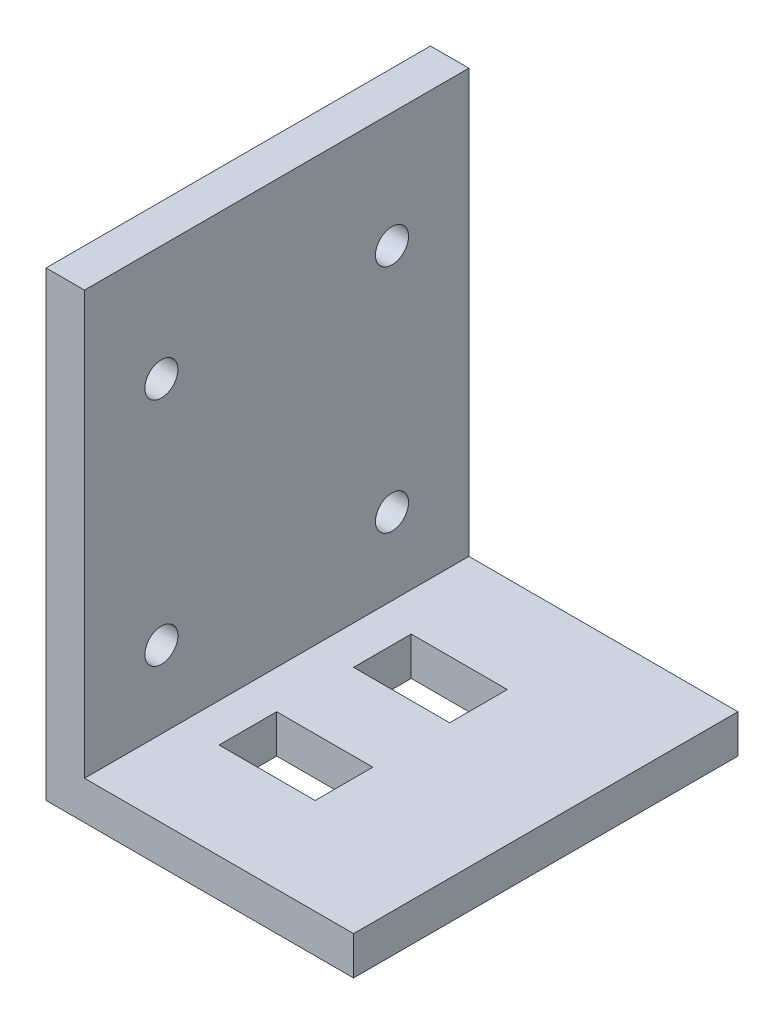
ISO-10303-21;
HEADER;
FILE_DESCRIPTION(('STEP AP214'),'2;1');
FILE_NAME('part.step','',(''),(''),'','','');
FILE_SCHEMA(('AUTOMOTIVE_DESIGN { 1 0 10303 214 1 1 1 1 }'));
ENDSEC;
DATA;
#1=APPLICATION_CONTEXT('core data for automotive mechanical design processes');
#2=APPLICATION_PROTOCOL_DEFINITION('international standard','automotive_design',2000,#1);
#3=PRODUCT_CONTEXT('',#1,'mechanical');
#4=PRODUCT('Part','Part','',(#3));
#5=PRODUCT_RELATED_PRODUCT_CATEGORY('part','',(#4));
#6=PRODUCT_DEFINITION_FORMATION('','',#4);
#7=PRODUCT_DEFINITION_CONTEXT('part definition',#1,'design');
#8=PRODUCT_DEFINITION('design','',#6,#7);
#9=PRODUCT_DEFINITION_SHAPE('','',#8);
#10=(LENGTH_UNIT() NAMED_UNIT(*) SI_UNIT(.MILLI.,.METRE.));
#11=(NAMED_UNIT(*) PLANE_ANGLE_UNIT() SI_UNIT($,.RADIAN.));
#12=(NAMED_UNIT(*) SI_UNIT($,.STERADIAN.) SOLID_ANGLE_UNIT());
#13=UNCERTAINTY_MEASURE_WITH_UNIT(LENGTH_MEASURE(1.E-05),#10,'distance_accuracy_value','');
#14=(GEOMETRIC_REPRESENTATION_CONTEXT(3) GLOBAL_UNCERTAINTY_ASSIGNED_CONTEXT((#13)) GLOBAL_UNIT_ASSIGNED_CONTEXT((#10,
#11,#12)) REPRESENTATION_CONTEXT('',''));
#15=CARTESIAN_POINT('',(0.,0.,0.));
#16=DIRECTION('',(0.,0.,1.));
#17=DIRECTION('',(1.,0.,0.));
#18=AXIS2_PLACEMENT_3D('',#15,#16,#17);
#19=CARTESIAN_POINT('',(0.,0.,31.75));
#20=DIRECTION('',(1.,0.,0.));
#21=DIRECTION('',(0.,0.,-1.));
#22=AXIS2_PLACEMENT_3D('',#19,#20,#21);
#23=PLANE('',#22);
#24=CARTESIAN_POINT('',(0.,9.52499999999999,6.35));
#25=DIRECTION('',(1.,0.,0.));
#26=DIRECTION('',(0.,1.,0.));
#27=AXIS2_PLACEMENT_3D('',#24,#25,#26);
#28=CIRCLE('',#27,1.36672863493814);
#29=CARTESIAN_POINT('',(0.,10.8917286349381,6.35));
#30=VERTEX_POINT('',#29);
#31=EDGE_CURVE('E202',#30,#30,#28,.T.);
#32=ORIENTED_EDGE('',*,*,#31,.T.);
#33=EDGE_LOOP('',(#32));
#34=FACE_BOUND('',#33,.T.);
#35=CARTESIAN_POINT('',(0.,9.52499999999999,25.4));
#36=DIRECTION('',(1.,0.,0.));
#37=DIRECTION('',(0.,1.,0.));
#38=AXIS2_PLACEMENT_3D('',#35,#36,#37);
#39=CIRCLE('',#38,1.36672863493814);
#40=CARTESIAN_POINT('',(0.,10.8917286349381,25.4));
#41=VERTEX_POINT('',#40);
#42=EDGE_CURVE('E208',#41,#41,#39,.T.);
#43=ORIENTED_EDGE('',*,*,#42,.T.);
#44=EDGE_LOOP('',(#43));
#45=FACE_BOUND('',#44,.T.);
#46=CARTESIAN_POINT('',(0.,28.575,6.35));
#47=DIRECTION('',(1.,0.,0.));
#48=DIRECTION('',(0.,1.,0.));
#49=AXIS2_PLACEMENT_3D('',#46,#47,#48);
#50=CIRCLE('',#49,1.36672863493814);
#51=CARTESIAN_POINT('',(0.,29.9417286349381,6.35));
#52=VERTEX_POINT('',#51);
#53=EDGE_CURVE('E214',#52,#52,#50,.T.);
#54=ORIENTED_EDGE('',*,*,#53,.T.);
#55=EDGE_LOOP('',(#54));
#56=FACE_BOUND('',#55,.T.);
#57=CARTESIAN_POINT('',(0.,28.575,25.4));
#58=DIRECTION('',(1.,0.,0.));
#59=DIRECTION('',(0.,1.,0.));
#60=AXIS2_PLACEMENT_3D('',#57,#58,#59);
#61=CIRCLE('',#60,1.36672863493814);
#62=CARTESIAN_POINT('',(0.,29.9417286349381,25.4));
#63=VERTEX_POINT('',#62);
#64=EDGE_CURVE('E220',#63,#63,#61,.T.);
#65=ORIENTED_EDGE('',*,*,#64,.T.);
#66=EDGE_LOOP('',(#65));
#67=FACE_BOUND('',#66,.T.);
#68=DIRECTION('',(0.,-1.,0.));
#69=VECTOR('',#68,1.);
#70=CARTESIAN_POINT('',(0.,0.,0.));
#71=LINE('',#70,#69);
#72=CARTESIAN_POINT('',(0.,38.1,0.));
#73=VERTEX_POINT('',#72);
#74=CARTESIAN_POINT('',(0.,0.,0.));
#75=VERTEX_POINT('',#74);
#76=EDGE_CURVE('E223',#73,#75,#71,.T.);
#77=ORIENTED_EDGE('',*,*,#76,.T.);
#78=DIRECTION('',(0.,0.,-1.));
#79=VECTOR('',#78,1.);
#80=CARTESIAN_POINT('',(0.,0.,31.75));
#81=LINE('',#80,#79);
#82=CARTESIAN_POINT('',(0.,0.,31.75));
#83=VERTEX_POINT('',#82);
#84=EDGE_CURVE('E11',#83,#75,#81,.T.);
#85=ORIENTED_EDGE('',*,*,#84,.F.);
#86=DIRECTION('',(0.,-1.,0.));
#87=VECTOR('',#86,1.);
#88=CARTESIAN_POINT('',(0.,0.,31.75));
#89=LINE('',#88,#87);
#90=CARTESIAN_POINT('',(0.,38.1,31.75));
#91=VERTEX_POINT('',#90);
#92=EDGE_CURVE('E226',#91,#83,#89,.T.);
#93=ORIENTED_EDGE('',*,*,#92,.F.);
#94=DIRECTION('',(0.,0.,-1.));
#95=VECTOR('',#94,1.);
#96=CARTESIAN_POINT('',(0.,38.1,31.75));
#97=LINE('',#96,#95);
#98=EDGE_CURVE('E240',#91,#73,#97,.T.);
#99=ORIENTED_EDGE('',*,*,#98,.T.);
#100=EDGE_LOOP('',(#77,#85,#93,#99));
#101=FACE_BOUND('',#100,.T.);
#102=ADVANCED_FACE('F33',(#34,#45,#56,#67,#101),#23,.F.);
#103=CARTESIAN_POINT('',(0.,0.,31.75));
#104=DIRECTION('',(0.,1.,0.));
#105=DIRECTION('',(0.,0.,1.));
#106=AXIS2_PLACEMENT_3D('',#103,#104,#105);
#107=PLANE('',#106);
#108=DIRECTION('',(-1.,0.,0.));
#109=VECTOR('',#108,1.);
#110=CARTESIAN_POINT('',(6.35,0.,7.9375));
#111=LINE('',#110,#109);
#112=CARTESIAN_POINT('',(14.2875,0.,7.9375));
#113=VERTEX_POINT('',#112);
#114=CARTESIAN_POINT('',(6.35,0.,7.9375));
#115=VERTEX_POINT('',#114);
#116=EDGE_CURVE('E141',#113,#115,#111,.T.);
#117=ORIENTED_EDGE('',*,*,#116,.T.);
#118=DIRECTION('',(0.,0.,1.));
#119=VECTOR('',#118,1.);
#120=CARTESIAN_POINT('',(6.35,0.,12.7));
#121=LINE('',#120,#119);
#122=CARTESIAN_POINT('',(6.35,0.,12.7));
#123=VERTEX_POINT('',#122);
#124=EDGE_CURVE('E135',#115,#123,#121,.T.);
#125=ORIENTED_EDGE('',*,*,#124,.T.);
#126=DIRECTION('',(1.,0.,0.));
#127=VECTOR('',#126,1.);
#128=CARTESIAN_POINT('',(6.35,0.,12.7));
#129=LINE('',#128,#127);
#130=CARTESIAN_POINT('',(14.2875,0.,12.7));
#131=VERTEX_POINT('',#130);
#132=EDGE_CURVE('E144',#123,#131,#129,.T.);
#133=ORIENTED_EDGE('',*,*,#132,.T.);
#134=DIRECTION('',(0.,0.,-1.));
#135=VECTOR('',#134,1.);
#136=CARTESIAN_POINT('',(14.2875,0.,12.7));
#137=LINE('',#136,#135);
#138=EDGE_CURVE('E47',#131,#113,#137,.T.);
#139=ORIENTED_EDGE('',*,*,#138,.T.);
#140=EDGE_LOOP('',(#117,#125,#133,#139));
#141=FACE_BOUND('',#140,.T.);
#142=DIRECTION('',(-1.,0.,0.));
#143=VECTOR('',#142,1.);
#144=CARTESIAN_POINT('',(6.35,0.,19.05));
#145=LINE('',#144,#143);
#146=CARTESIAN_POINT('',(14.2875,0.,19.05));
#147=VERTEX_POINT('',#146);
#148=CARTESIAN_POINT('',(6.35,0.,19.05));
#149=VERTEX_POINT('',#148);
#150=EDGE_CURVE('E180',#147,#149,#145,.T.);
#151=ORIENTED_EDGE('',*,*,#150,.T.);
#152=DIRECTION('',(0.,0.,1.));
#153=VECTOR('',#152,1.);
#154=CARTESIAN_POINT('',(6.35,0.,23.8125));
#155=LINE('',#154,#153);
#156=CARTESIAN_POINT('',(6.35,0.,23.8125));
#157=VERTEX_POINT('',#156);
#158=EDGE_CURVE('E170',#149,#157,#155,.T.);
#159=ORIENTED_EDGE('',*,*,#158,.T.);
#160=DIRECTION('',(1.,0.,0.));
#161=VECTOR('',#160,1.);
#162=CARTESIAN_POINT('',(6.35,0.,23.8125));
#163=LINE('',#162,#161);
#164=CARTESIAN_POINT('',(14.2875,0.,23.8125));
#165=VERTEX_POINT('',#164);
#166=EDGE_CURVE('E173',#157,#165,#163,.T.);
#167=ORIENTED_EDGE('',*,*,#166,.T.);
#168=DIRECTION('',(0.,0.,-1.));
#169=VECTOR('',#168,1.);
#170=CARTESIAN_POINT('',(14.2875,0.,23.8125));
#171=LINE('',#170,#169);
#172=EDGE_CURVE('E177',#165,#147,#171,.T.);
#173=ORIENTED_EDGE('',*,*,#172,.T.);
#174=EDGE_LOOP('',(#151,#159,#167,#173));
#175=FACE_BOUND('',#174,.T.);
#176=DIRECTION('',(1.,0.,0.));
#177=VECTOR('',#176,1.);
#178=CARTESIAN_POINT('',(0.,0.,0.));
#179=LINE('',#178,#177);
#180=CARTESIAN_POINT('',(25.4,0.,0.));
#181=VERTEX_POINT('',#180);
#182=EDGE_CURVE('E243',#75,#181,#179,.T.);
#183=ORIENTED_EDGE('',*,*,#182,.T.);
#184=DIRECTION('',(0.,0.,-1.));
#185=VECTOR('',#184,1.);
#186=CARTESIAN_POINT('',(25.4,0.,31.75));
#187=LINE('',#186,#185);
#188=CARTESIAN_POINT('',(25.4,0.,31.75));
#189=VERTEX_POINT('',#188);
#190=EDGE_CURVE('E40',#189,#181,#187,.T.);
#191=ORIENTED_EDGE('',*,*,#190,.F.);
#192=DIRECTION('',(1.,0.,0.));
#193=VECTOR('',#192,1.);
#194=CARTESIAN_POINT('',(0.,0.,31.75));
#195=LINE('',#194,#193);
#196=EDGE_CURVE('E229',#83,#189,#195,.T.);
#197=ORIENTED_EDGE('',*,*,#196,.F.);
#198=ORIENTED_EDGE('',*,*,#84,.T.);
#199=EDGE_LOOP('',(#183,#191,#197,#198));
#200=FACE_BOUND('',#199,.T.);
#201=ADVANCED_FACE('F148',(#141,#175,#200),#107,.F.);
#202=CARTESIAN_POINT('',(25.4,0.,31.75));
#203=DIRECTION('',(-1.,0.,0.));
#204=DIRECTION('',(0.,0.,1.));
#205=AXIS2_PLACEMENT_3D('',#202,#203,#204);
#206=PLANE('',#205);
#207=DIRECTION('',(0.,1.,0.));
#208=VECTOR('',#207,1.);
#209=CARTESIAN_POINT('',(25.4,0.,0.));
#210=LINE('',#209,#208);
#211=CARTESIAN_POINT('',(25.4,3.175,0.));
#212=VERTEX_POINT('',#211);
#213=EDGE_CURVE('E245',#181,#212,#210,.T.);
#214=ORIENTED_EDGE('',*,*,#213,.T.);
#215=DIRECTION('',(0.,0.,-1.));
#216=VECTOR('',#215,1.);
#217=CARTESIAN_POINT('',(25.4,3.175,31.75));
#218=LINE('',#217,#216);
#219=CARTESIAN_POINT('',(25.4,3.175,31.75));
#220=VERTEX_POINT('',#219);
#221=EDGE_CURVE('E260',#220,#212,#218,.T.);
#222=ORIENTED_EDGE('',*,*,#221,.F.);
#223=DIRECTION('',(0.,1.,0.));
#224=VECTOR('',#223,1.);
#225=CARTESIAN_POINT('',(25.4,0.,31.75));
#226=LINE('',#225,#224);
#227=EDGE_CURVE('E232',#189,#220,#226,.T.);
#228=ORIENTED_EDGE('',*,*,#227,.F.);
#229=ORIENTED_EDGE('',*,*,#190,.T.);
#230=EDGE_LOOP('',(#214,#222,#228,#229));
#231=FACE_BOUND('',#230,.T.);
#232=ADVANCED_FACE('F267',(#231),#206,.F.);
#233=CARTESIAN_POINT('',(25.4,3.175,31.75));
#234=DIRECTION('',(0.,-1.,0.));
#235=DIRECTION('',(1.,0.,0.));
#236=AXIS2_PLACEMENT_3D('',#233,#234,#235);
#237=PLANE('',#236);
#238=DIRECTION('',(1.,0.,0.));
#239=VECTOR('',#238,1.);
#240=CARTESIAN_POINT('',(6.35,3.17499999999999,12.7));
#241=LINE('',#240,#239);
#242=CARTESIAN_POINT('',(6.35000000000001,3.17499999999999,12.7));
#243=VERTEX_POINT('',#242);
#244=CARTESIAN_POINT('',(14.2875,3.175,12.7));
#245=VERTEX_POINT('',#244);
#246=EDGE_CURVE('E160',#243,#245,#241,.T.);
#247=ORIENTED_EDGE('',*,*,#246,.F.);
#248=DIRECTION('',(0.,0.,1.));
#249=VECTOR('',#248,1.);
#250=CARTESIAN_POINT('',(6.35,3.17499999999999,12.7));
#251=LINE('',#250,#249);
#252=CARTESIAN_POINT('',(6.35,3.17499999999999,7.9375));
#253=VERTEX_POINT('',#252);
#254=EDGE_CURVE('E55',#253,#243,#251,.T.);
#255=ORIENTED_EDGE('',*,*,#254,.F.);
#256=DIRECTION('',(-1.,0.,0.));
#257=VECTOR('',#256,1.);
#258=CARTESIAN_POINT('',(6.35,3.17499999999999,7.9375));
#259=LINE('',#258,#257);
#260=CARTESIAN_POINT('',(14.2875,3.175,7.9375));
#261=VERTEX_POINT('',#260);
#262=EDGE_CURVE('E151',#261,#253,#259,.T.);
#263=ORIENTED_EDGE('',*,*,#262,.F.);
#264=DIRECTION('',(0.,0.,-1.));
#265=VECTOR('',#264,1.);
#266=CARTESIAN_POINT('',(14.2875,3.175,12.7));
#267=LINE('',#266,#265);
#268=EDGE_CURVE('E154',#245,#261,#267,.T.);
#269=ORIENTED_EDGE('',*,*,#268,.F.);
#270=EDGE_LOOP('',(#247,#255,#263,#269));
#271=FACE_BOUND('',#270,.T.);
#272=DIRECTION('',(1.,0.,0.));
#273=VECTOR('',#272,1.);
#274=CARTESIAN_POINT('',(6.35,3.17499999999999,23.8125));
#275=LINE('',#274,#273);
#276=CARTESIAN_POINT('',(6.35,3.17499999999999,23.8125));
#277=VERTEX_POINT('',#276);
#278=CARTESIAN_POINT('',(14.2875,3.175,23.8125));
#279=VERTEX_POINT('',#278);
#280=EDGE_CURVE('E185',#277,#279,#275,.T.);
#281=ORIENTED_EDGE('',*,*,#280,.F.);
#282=DIRECTION('',(0.,0.,1.));
#283=VECTOR('',#282,1.);
#284=CARTESIAN_POINT('',(6.35,3.17499999999999,23.8125));
#285=LINE('',#284,#283);
#286=CARTESIAN_POINT('',(6.35,3.17499999999999,19.05));
#287=VERTEX_POINT('',#286);
#288=EDGE_CURVE('E166',#287,#277,#285,.T.);
#289=ORIENTED_EDGE('',*,*,#288,.F.);
#290=DIRECTION('',(-1.,0.,0.));
#291=VECTOR('',#290,1.);
#292=CARTESIAN_POINT('',(6.35,3.17499999999999,19.05));
#293=LINE('',#292,#291);
#294=CARTESIAN_POINT('',(14.2875,3.175,19.05));
#295=VERTEX_POINT('',#294);
#296=EDGE_CURVE('E174',#295,#287,#293,.T.);
#297=ORIENTED_EDGE('',*,*,#296,.F.);
#298=DIRECTION('',(0.,0.,-1.));
#299=VECTOR('',#298,1.);
#300=CARTESIAN_POINT('',(14.2875,3.175,23.8125));
#301=LINE('',#300,#299);
#302=EDGE_CURVE('E188',#279,#295,#301,.T.);
#303=ORIENTED_EDGE('',*,*,#302,.F.);
#304=EDGE_LOOP('',(#281,#289,#297,#303));
#305=FACE_BOUND('',#304,.T.);
#306=DIRECTION('',(-1.,0.,0.));
#307=VECTOR('',#306,1.);
#308=CARTESIAN_POINT('',(25.4,3.175,0.));
#309=LINE('',#308,#307);
#310=CARTESIAN_POINT('',(3.175,3.17499999999999,0.));
#311=VERTEX_POINT('',#310);
#312=EDGE_CURVE('E247',#212,#311,#309,.T.);
#313=ORIENTED_EDGE('',*,*,#312,.T.);
#314=DIRECTION('',(0.,0.,-1.));
#315=VECTOR('',#314,1.);
#316=CARTESIAN_POINT('',(3.175,3.17499999999999,31.75));
#317=LINE('',#316,#315);
#318=CARTESIAN_POINT('',(3.175,3.17499999999999,31.75));
#319=VERTEX_POINT('',#318);
#320=EDGE_CURVE('E257',#319,#311,#317,.T.);
#321=ORIENTED_EDGE('',*,*,#320,.F.);
#322=DIRECTION('',(-1.,0.,0.));
#323=VECTOR('',#322,1.);
#324=CARTESIAN_POINT('',(25.4,3.175,31.75));
#325=LINE('',#324,#323);
#326=EDGE_CURVE('E234',#220,#319,#325,.T.);
#327=ORIENTED_EDGE('',*,*,#326,.F.);
#328=ORIENTED_EDGE('',*,*,#221,.T.);
#329=EDGE_LOOP('',(#313,#321,#327,#328));
#330=FACE_BOUND('',#329,.T.);
#331=ADVANCED_FACE('F278',(#271,#305,#330),#237,.F.);
#332=CARTESIAN_POINT('',(3.175,38.1,31.75));
#333=DIRECTION('',(-1.,0.,0.));
#334=DIRECTION('',(0.,-1.,0.));
#335=AXIS2_PLACEMENT_3D('',#332,#333,#334);
#336=PLANE('',#335);
#337=CARTESIAN_POINT('',(3.175,9.52499999999999,6.35));
#338=DIRECTION('',(1.,0.,0.));
#339=DIRECTION('',(0.,1.,0.));
#340=AXIS2_PLACEMENT_3D('',#337,#338,#339);
#341=CIRCLE('',#340,1.36672863493814);
#342=CARTESIAN_POINT('',(3.175,10.8917286349381,6.35));
#343=VERTEX_POINT('',#342);
#344=EDGE_CURVE('E195',#343,#343,#341,.T.);
#345=ORIENTED_EDGE('',*,*,#344,.F.);
#346=EDGE_LOOP('',(#345));
#347=FACE_BOUND('',#346,.T.);
#348=CARTESIAN_POINT('',(3.175,9.52499999999999,25.4));
#349=DIRECTION('',(1.,0.,0.));
#350=DIRECTION('',(0.,1.,0.));
#351=AXIS2_PLACEMENT_3D('',#348,#349,#350);
#352=CIRCLE('',#351,1.36672863493814);
#353=CARTESIAN_POINT('',(3.175,10.8917286349381,25.4));
#354=VERTEX_POINT('',#353);
#355=EDGE_CURVE('E205',#354,#354,#352,.T.);
#356=ORIENTED_EDGE('',*,*,#355,.F.);
#357=EDGE_LOOP('',(#356));
#358=FACE_BOUND('',#357,.T.);
#359=CARTESIAN_POINT('',(3.175,28.575,6.35));
#360=DIRECTION('',(1.,0.,0.));
#361=DIRECTION('',(0.,1.,0.));
#362=AXIS2_PLACEMENT_3D('',#359,#360,#361);
#363=CIRCLE('',#362,1.36672863493814);
#364=CARTESIAN_POINT('',(3.175,29.9417286349381,6.35));
#365=VERTEX_POINT('',#364);
#366=EDGE_CURVE('E211',#365,#365,#363,.T.);
#367=ORIENTED_EDGE('',*,*,#366,.F.);
#368=EDGE_LOOP('',(#367));
#369=FACE_BOUND('',#368,.T.);
#370=CARTESIAN_POINT('',(3.175,28.575,25.4));
#371=DIRECTION('',(1.,0.,0.));
#372=DIRECTION('',(0.,1.,0.));
#373=AXIS2_PLACEMENT_3D('',#370,#371,#372);
#374=CIRCLE('',#373,1.36672863493814);
#375=CARTESIAN_POINT('',(3.175,29.9417286349381,25.4));
#376=VERTEX_POINT('',#375);
#377=EDGE_CURVE('E217',#376,#376,#374,.T.);
#378=ORIENTED_EDGE('',*,*,#377,.F.);
#379=EDGE_LOOP('',(#378));
#380=FACE_BOUND('',#379,.T.);
#381=DIRECTION('',(0.,1.,0.));
#382=VECTOR('',#381,1.);
#383=CARTESIAN_POINT('',(3.175,38.1,0.));
#384=LINE('',#383,#382);
#385=CARTESIAN_POINT('',(3.175,38.1,0.));
#386=VERTEX_POINT('',#385);
#387=EDGE_CURVE('E249',#311,#386,#384,.T.);
#388=ORIENTED_EDGE('',*,*,#387,.T.);
#389=DIRECTION('',(0.,0.,-1.));
#390=VECTOR('',#389,1.);
#391=CARTESIAN_POINT('',(3.175,38.1,31.75));
#392=LINE('',#391,#390);
#393=CARTESIAN_POINT('',(3.175,38.1,31.75));
#394=VERTEX_POINT('',#393);
#395=EDGE_CURVE('E254',#394,#386,#392,.T.);
#396=ORIENTED_EDGE('',*,*,#395,.F.);
#397=DIRECTION('',(0.,1.,0.));
#398=VECTOR('',#397,1.);
#399=CARTESIAN_POINT('',(3.175,38.1,31.75));
#400=LINE('',#399,#398);
#401=EDGE_CURVE('E236',#319,#394,#400,.T.);
#402=ORIENTED_EDGE('',*,*,#401,.F.);
#403=ORIENTED_EDGE('',*,*,#320,.T.);
#404=EDGE_LOOP('',(#388,#396,#402,#403));
#405=FACE_BOUND('',#404,.T.);
#406=ADVANCED_FACE('F282',(#347,#358,#369,#380,#405),#336,.F.);
#407=CARTESIAN_POINT('',(0.,38.1,31.75));
#408=DIRECTION('',(0.,-1.,0.));
#409=DIRECTION('',(0.,0.,-1.));
#410=AXIS2_PLACEMENT_3D('',#407,#408,#409);
#411=PLANE('',#410);
#412=DIRECTION('',(-1.,0.,0.));
#413=VECTOR('',#412,1.);
#414=CARTESIAN_POINT('',(0.,38.1,0.));
#415=LINE('',#414,#413);
#416=EDGE_CURVE('E230',#386,#73,#415,.T.);
#417=ORIENTED_EDGE('',*,*,#416,.T.);
#418=ORIENTED_EDGE('',*,*,#98,.F.);
#419=DIRECTION('',(-1.,0.,0.));
#420=VECTOR('',#419,1.);
#421=CARTESIAN_POINT('',(0.,38.1,31.75));
#422=LINE('',#421,#420);
#423=EDGE_CURVE('E238',#394,#91,#422,.T.);
#424=ORIENTED_EDGE('',*,*,#423,.F.);
#425=ORIENTED_EDGE('',*,*,#395,.T.);
#426=EDGE_LOOP('',(#417,#418,#424,#425));
#427=FACE_BOUND('',#426,.T.);
#428=ADVANCED_FACE('F292',(#427),#411,.F.);
#429=CARTESIAN_POINT('',(0.,0.,31.75));
#430=DIRECTION('',(0.,0.,-1.));
#431=DIRECTION('',(-1.,0.,0.));
#432=AXIS2_PLACEMENT_3D('',#429,#430,#431);
#433=PLANE('',#432);
#434=ORIENTED_EDGE('',*,*,#92,.T.);
#435=ORIENTED_EDGE('',*,*,#196,.T.);
#436=ORIENTED_EDGE('',*,*,#227,.T.);
#437=ORIENTED_EDGE('',*,*,#326,.T.);
#438=ORIENTED_EDGE('',*,*,#401,.T.);
#439=ORIENTED_EDGE('',*,*,#423,.T.);
#440=EDGE_LOOP('',(#434,#435,#436,#437,#438,#439));
#441=FACE_BOUND('',#440,.T.);
#442=ADVANCED_FACE('F286',(#441),#433,.F.);
#443=CARTESIAN_POINT('',(0.,0.,0.));
#444=DIRECTION('',(0.,0.,-1.));
#445=DIRECTION('',(-1.,0.,0.));
#446=AXIS2_PLACEMENT_3D('',#443,#444,#445);
#447=PLANE('',#446);
#448=ORIENTED_EDGE('',*,*,#76,.F.);
#449=ORIENTED_EDGE('',*,*,#416,.F.);
#450=ORIENTED_EDGE('',*,*,#387,.F.);
#451=ORIENTED_EDGE('',*,*,#312,.F.);
#452=ORIENTED_EDGE('',*,*,#213,.F.);
#453=ORIENTED_EDGE('',*,*,#182,.F.);
#454=EDGE_LOOP('',(#448,#449,#450,#451,#452,#453));
#455=FACE_BOUND('',#454,.T.);
#456=ADVANCED_FACE('F273',(#455),#447,.T.);
#457=CARTESIAN_POINT('',(0.,28.575,25.4));
#458=DIRECTION('',(1.,0.,0.));
#459=DIRECTION('',(0.,1.,0.));
#460=AXIS2_PLACEMENT_3D('',#457,#458,#459);
#461=CYLINDRICAL_SURFACE('',#460,1.36672863493814);
#462=ORIENTED_EDGE('',*,*,#64,.F.);
#463=EDGE_LOOP('',(#462));
#464=FACE_BOUND('',#463,.T.);
#465=ORIENTED_EDGE('',*,*,#377,.T.);
#466=EDGE_LOOP('',(#465));
#467=FACE_BOUND('',#466,.T.);
#468=ADVANCED_FACE('F316',(#464,#467),#461,.F.);
#469=CARTESIAN_POINT('',(0.,28.575,6.35));
#470=DIRECTION('',(1.,0.,0.));
#471=DIRECTION('',(0.,1.,0.));
#472=AXIS2_PLACEMENT_3D('',#469,#470,#471);
#473=CYLINDRICAL_SURFACE('',#472,1.36672863493814);
#474=ORIENTED_EDGE('',*,*,#53,.F.);
#475=EDGE_LOOP('',(#474));
#476=FACE_BOUND('',#475,.T.);
#477=ORIENTED_EDGE('',*,*,#366,.T.);
#478=EDGE_LOOP('',(#477));
#479=FACE_BOUND('',#478,.T.);
#480=ADVANCED_FACE('F319',(#476,#479),#473,.F.);
#481=CARTESIAN_POINT('',(0.,9.52499999999999,25.4));
#482=DIRECTION('',(1.,0.,0.));
#483=DIRECTION('',(0.,1.,0.));
#484=AXIS2_PLACEMENT_3D('',#481,#482,#483);
#485=CYLINDRICAL_SURFACE('',#484,1.36672863493814);
#486=ORIENTED_EDGE('',*,*,#42,.F.);
#487=EDGE_LOOP('',(#486));
#488=FACE_BOUND('',#487,.T.);
#489=ORIENTED_EDGE('',*,*,#355,.T.);
#490=EDGE_LOOP('',(#489));
#491=FACE_BOUND('',#490,.T.);
#492=ADVANCED_FACE('F327',(#488,#491),#485,.F.);
#493=CARTESIAN_POINT('',(0.,9.52499999999999,6.35));
#494=DIRECTION('',(1.,0.,0.));
#495=DIRECTION('',(0.,1.,0.));
#496=AXIS2_PLACEMENT_3D('',#493,#494,#495);
#497=CYLINDRICAL_SURFACE('',#496,1.36672863493814);
#498=ORIENTED_EDGE('',*,*,#31,.F.);
#499=EDGE_LOOP('',(#498));
#500=FACE_BOUND('',#499,.T.);
#501=ORIENTED_EDGE('',*,*,#344,.T.);
#502=EDGE_LOOP('',(#501));
#503=FACE_BOUND('',#502,.T.);
#504=ADVANCED_FACE('F333',(#500,#503),#497,.F.);
#505=CARTESIAN_POINT('',(6.35,0.,23.8125));
#506=DIRECTION('',(-1.,0.,0.));
#507=DIRECTION('',(0.,-1.,0.));
#508=AXIS2_PLACEMENT_3D('',#505,#506,#507);
#509=PLANE('',#508);
#510=ORIENTED_EDGE('',*,*,#288,.T.);
#511=DIRECTION('',(0.,1.,0.));
#512=VECTOR('',#511,1.);
#513=CARTESIAN_POINT('',(6.35,0.,23.8125));
#514=LINE('',#513,#512);
#515=EDGE_CURVE('E183',#157,#277,#514,.T.);
#516=ORIENTED_EDGE('',*,*,#515,.F.);
#517=ORIENTED_EDGE('',*,*,#158,.F.);
#518=DIRECTION('',(0.,1.,0.));
#519=VECTOR('',#518,1.);
#520=CARTESIAN_POINT('',(6.35,0.,19.05));
#521=LINE('',#520,#519);
#522=EDGE_CURVE('E193',#149,#287,#521,.T.);
#523=ORIENTED_EDGE('',*,*,#522,.T.);
#524=EDGE_LOOP('',(#510,#516,#517,#523));
#525=FACE_BOUND('',#524,.T.);
#526=ADVANCED_FACE('F337',(#525),#509,.F.);
#527=CARTESIAN_POINT('',(6.35,0.,19.05));
#528=DIRECTION('',(0.,0.,-1.));
#529=DIRECTION('',(-1.,0.,0.));
#530=AXIS2_PLACEMENT_3D('',#527,#528,#529);
#531=PLANE('',#530);
#532=ORIENTED_EDGE('',*,*,#296,.T.);
#533=ORIENTED_EDGE('',*,*,#522,.F.);
#534=ORIENTED_EDGE('',*,*,#150,.F.);
#535=DIRECTION('',(0.,1.,0.));
#536=VECTOR('',#535,1.);
#537=CARTESIAN_POINT('',(14.2875,0.,19.05));
#538=LINE('',#537,#536);
#539=EDGE_CURVE('E196',#147,#295,#538,.T.);
#540=ORIENTED_EDGE('',*,*,#539,.T.);
#541=EDGE_LOOP('',(#532,#533,#534,#540));
#542=FACE_BOUND('',#541,.T.);
#543=ADVANCED_FACE('F341',(#542),#531,.F.);
#544=CARTESIAN_POINT('',(14.2875,0.,23.8125));
#545=DIRECTION('',(1.,0.,0.));
#546=DIRECTION('',(0.,1.,0.));
#547=AXIS2_PLACEMENT_3D('',#544,#545,#546);
#548=PLANE('',#547);
#549=ORIENTED_EDGE('',*,*,#302,.T.);
#550=ORIENTED_EDGE('',*,*,#539,.F.);
#551=ORIENTED_EDGE('',*,*,#172,.F.);
#552=DIRECTION('',(0.,1.,0.));
#553=VECTOR('',#552,1.);
#554=CARTESIAN_POINT('',(14.2875,0.,23.8125));
#555=LINE('',#554,#553);
#556=EDGE_CURVE('E198',#165,#279,#555,.T.);
#557=ORIENTED_EDGE('',*,*,#556,.T.);
#558=EDGE_LOOP('',(#549,#550,#551,#557));
#559=FACE_BOUND('',#558,.T.);
#560=ADVANCED_FACE('F346',(#559),#548,.F.);
#561=CARTESIAN_POINT('',(6.35,0.,23.8125));
#562=DIRECTION('',(0.,0.,1.));
#563=DIRECTION('',(1.,0.,0.));
#564=AXIS2_PLACEMENT_3D('',#561,#562,#563);
#565=PLANE('',#564);
#566=ORIENTED_EDGE('',*,*,#280,.T.);
#567=ORIENTED_EDGE('',*,*,#556,.F.);
#568=ORIENTED_EDGE('',*,*,#166,.F.);
#569=ORIENTED_EDGE('',*,*,#515,.T.);
#570=EDGE_LOOP('',(#566,#567,#568,#569));
#571=FACE_BOUND('',#570,.T.);
#572=ADVANCED_FACE('F343',(#571),#565,.F.);
#573=CARTESIAN_POINT('',(6.35,0.,12.7));
#574=DIRECTION('',(-1.,0.,0.));
#575=DIRECTION('',(0.,-1.,0.));
#576=AXIS2_PLACEMENT_3D('',#573,#574,#575);
#577=PLANE('',#576);
#578=ORIENTED_EDGE('',*,*,#254,.T.);
#579=DIRECTION('',(0.,1.,0.));
#580=VECTOR('',#579,1.);
#581=CARTESIAN_POINT('',(6.35,0.,12.7));
#582=LINE('',#581,#580);
#583=EDGE_CURVE('E131',#123,#243,#582,.T.);
#584=ORIENTED_EDGE('',*,*,#583,.F.);
#585=ORIENTED_EDGE('',*,*,#124,.F.);
#586=DIRECTION('',(0.,1.,0.));
#587=VECTOR('',#586,1.);
#588=CARTESIAN_POINT('',(6.35,0.,7.9375));
#589=LINE('',#588,#587);
#590=EDGE_CURVE('E164',#115,#253,#589,.T.);
#591=ORIENTED_EDGE('',*,*,#590,.T.);
#592=EDGE_LOOP('',(#578,#584,#585,#591));
#593=FACE_BOUND('',#592,.T.);
#594=ADVANCED_FACE('F133',(#593),#577,.F.);
#595=CARTESIAN_POINT('',(6.35,0.,7.9375));
#596=DIRECTION('',(0.,0.,-1.));
#597=DIRECTION('',(-1.,0.,0.));
#598=AXIS2_PLACEMENT_3D('',#595,#596,#597);
#599=PLANE('',#598);
#600=ORIENTED_EDGE('',*,*,#262,.T.);
#601=ORIENTED_EDGE('',*,*,#590,.F.);
#602=ORIENTED_EDGE('',*,*,#116,.F.);
#603=DIRECTION('',(0.,1.,0.));
#604=VECTOR('',#603,1.);
#605=CARTESIAN_POINT('',(14.2875,0.,7.9375));
#606=LINE('',#605,#604);
#607=EDGE_CURVE('E167',#113,#261,#606,.T.);
#608=ORIENTED_EDGE('',*,*,#607,.T.);
#609=EDGE_LOOP('',(#600,#601,#602,#608));
#610=FACE_BOUND('',#609,.T.);
#611=ADVANCED_FACE('F356',(#610),#599,.F.);
#612=CARTESIAN_POINT('',(14.2875,0.,12.7));
#613=DIRECTION('',(1.,0.,0.));
#614=DIRECTION('',(0.,1.,0.));
#615=AXIS2_PLACEMENT_3D('',#612,#613,#614);
#616=PLANE('',#615);
#617=ORIENTED_EDGE('',*,*,#268,.T.);
#618=ORIENTED_EDGE('',*,*,#607,.F.);
#619=ORIENTED_EDGE('',*,*,#138,.F.);
#620=DIRECTION('',(0.,1.,0.));
#621=VECTOR('',#620,1.);
#622=CARTESIAN_POINT('',(14.2875,0.,12.7));
#623=LINE('',#622,#621);
#624=EDGE_CURVE('E140',#131,#245,#623,.T.);
#625=ORIENTED_EDGE('',*,*,#624,.T.);
#626=EDGE_LOOP('',(#617,#618,#619,#625));
#627=FACE_BOUND('',#626,.T.);
#628=ADVANCED_FACE('F359',(#627),#616,.F.);
#629=CARTESIAN_POINT('',(6.35,0.,12.7));
#630=DIRECTION('',(0.,0.,1.));
#631=DIRECTION('',(1.,0.,0.));
#632=AXIS2_PLACEMENT_3D('',#629,#630,#631);
#633=PLANE('',#632);
#634=ORIENTED_EDGE('',*,*,#246,.T.);
#635=ORIENTED_EDGE('',*,*,#624,.F.);
#636=ORIENTED_EDGE('',*,*,#132,.F.);
#637=ORIENTED_EDGE('',*,*,#583,.T.);
#638=EDGE_LOOP('',(#634,#635,#636,#637));
#639=FACE_BOUND('',#638,.T.);
#640=ADVANCED_FACE('F145',(#639),#633,.F.);
#641=CLOSED_SHELL('',(#102,#201,#232,#331,#406,#428,#442,#456,#468,#480,#492,#504,#526,#543,
#560,#572,#594,#611,#628,#640));
#642=MANIFOLD_SOLID_BREP('B2',#641);
#643=ADVANCED_BREP_SHAPE_REPRESENTATION('',(#18,#642),#14);
#644=SHAPE_DEFINITION_REPRESENTATION(#9,#643);
ENDSEC;
END-ISO-10303-21;
